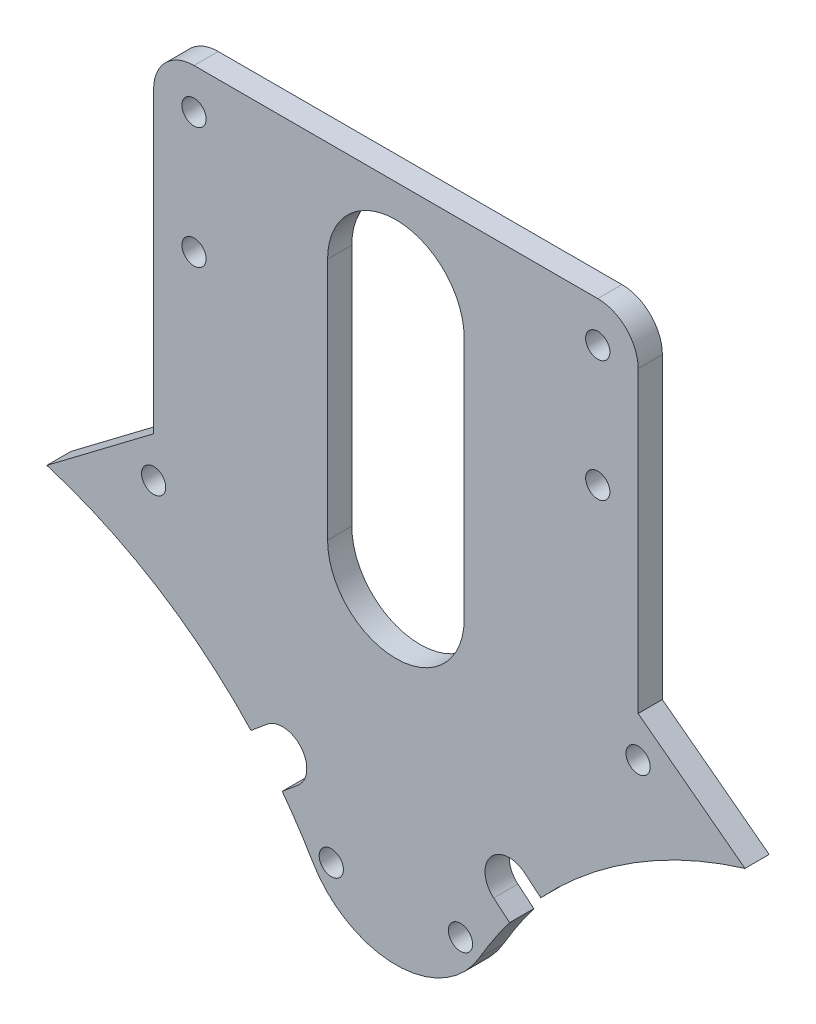
ISO-10303-21;
HEADER;
FILE_DESCRIPTION(('STEP AP214'),'2;1');
FILE_NAME('part.step','',(''),(''),'','','');
FILE_SCHEMA(('AUTOMOTIVE_DESIGN { 1 0 10303 214 1 1 1 1 }'));
ENDSEC;
DATA;
#1=APPLICATION_CONTEXT('core data for automotive mechanical design processes');
#2=APPLICATION_PROTOCOL_DEFINITION('international standard','automotive_design',2000,#1);
#3=PRODUCT_CONTEXT('',#1,'mechanical');
#4=PRODUCT('Part','Part','',(#3));
#5=PRODUCT_RELATED_PRODUCT_CATEGORY('part','',(#4));
#6=PRODUCT_DEFINITION_FORMATION('','',#4);
#7=PRODUCT_DEFINITION_CONTEXT('part definition',#1,'design');
#8=PRODUCT_DEFINITION('design','',#6,#7);
#9=PRODUCT_DEFINITION_SHAPE('','',#8);
#10=(LENGTH_UNIT() NAMED_UNIT(*) SI_UNIT(.MILLI.,.METRE.));
#11=(NAMED_UNIT(*) PLANE_ANGLE_UNIT() SI_UNIT($,.RADIAN.));
#12=(NAMED_UNIT(*) SI_UNIT($,.STERADIAN.) SOLID_ANGLE_UNIT());
#13=UNCERTAINTY_MEASURE_WITH_UNIT(LENGTH_MEASURE(1.E-05),#10,'distance_accuracy_value','');
#14=(GEOMETRIC_REPRESENTATION_CONTEXT(3) GLOBAL_UNCERTAINTY_ASSIGNED_CONTEXT((#13)) GLOBAL_UNIT_ASSIGNED_CONTEXT((#10,
#11,#12)) REPRESENTATION_CONTEXT('',''));
#15=CARTESIAN_POINT('',(0.,0.,0.));
#16=DIRECTION('',(0.,0.,1.));
#17=DIRECTION('',(1.,0.,0.));
#18=AXIS2_PLACEMENT_3D('',#15,#16,#17);
#19=CARTESIAN_POINT('',(-60.,-2.38152510246026E-13,3.));
#20=DIRECTION('',(0.,0.,-1.));
#21=DIRECTION('',(-1.,0.,0.));
#22=AXIS2_PLACEMENT_3D('',#19,#20,#21);
#23=CYLINDRICAL_SURFACE('',#22,57.5000000000001);
#24=CARTESIAN_POINT('',(-60.,-2.38152510246026E-13,3.));
#25=DIRECTION('',(0.,0.,1.));
#26=DIRECTION('',(1.,0.,0.));
#27=AXIS2_PLACEMENT_3D('',#24,#25,#26);
#28=CIRCLE('',#27,57.5000000000001);
#29=CARTESIAN_POINT('',(-14.0840738500869,34.6118148295597,3.));
#30=VERTEX_POINT('',#29);
#31=CARTESIAN_POINT('',(-10.3327131983401,28.972583967635,3.));
#32=VERTEX_POINT('',#31);
#33=EDGE_CURVE('E315',#30,#32,#28,.F.);
#34=ORIENTED_EDGE('',*,*,#33,.F.);
#35=DIRECTION('',(0.,0.,-1.));
#36=VECTOR('',#35,1.);
#37=CARTESIAN_POINT('',(-14.0840738500869,34.6118148295597,10.));
#38=LINE('',#37,#36);
#39=CARTESIAN_POINT('',(-14.0840738500869,34.6118148295597,0.));
#40=VERTEX_POINT('',#39);
#41=EDGE_CURVE('E261',#30,#40,#38,.T.);
#42=ORIENTED_EDGE('',*,*,#41,.T.);
#43=CARTESIAN_POINT('',(-60.,-2.38152510246026E-13,0.));
#44=DIRECTION('',(0.,0.,1.));
#45=DIRECTION('',(1.,0.,0.));
#46=AXIS2_PLACEMENT_3D('',#43,#44,#45);
#47=CIRCLE('',#46,57.5000000000001);
#48=CARTESIAN_POINT('',(-10.3327131983401,28.972583967635,0.));
#49=VERTEX_POINT('',#48);
#50=EDGE_CURVE('E348',#40,#49,#47,.F.);
#51=ORIENTED_EDGE('',*,*,#50,.T.);
#52=DIRECTION('',(0.,0.,-1.));
#53=VECTOR('',#52,1.);
#54=CARTESIAN_POINT('',(-10.3327131983401,28.972583967635,3.));
#55=LINE('',#54,#53);
#56=EDGE_CURVE('E369',#32,#49,#55,.T.);
#57=ORIENTED_EDGE('',*,*,#56,.F.);
#58=EDGE_LOOP('',(#34,#42,#51,#57));
#59=FACE_BOUND('',#58,.T.);
#60=ADVANCED_FACE('F36',(#59),#23,.F.);
#61=CARTESIAN_POINT('',(59.9999999999998,-4.18563751747614E-13,3.));
#62=DIRECTION('',(0.,0.,-1.));
#63=DIRECTION('',(-1.,0.,0.));
#64=AXIS2_PLACEMENT_3D('',#61,#62,#63);
#65=CYLINDRICAL_SURFACE('',#64,57.5000000000001);
#66=DIRECTION('',(0.,0.,-1.));
#67=VECTOR('',#66,1.);
#68=CARTESIAN_POINT('',(14.0840738500869,34.6118148295597,10.));
#69=LINE('',#68,#67);
#70=CARTESIAN_POINT('',(14.0840738500869,34.6118148295597,3.));
#71=VERTEX_POINT('',#70);
#72=CARTESIAN_POINT('',(14.0840738500869,34.6118148295597,0.));
#73=VERTEX_POINT('',#72);
#74=EDGE_CURVE('E278',#71,#73,#69,.T.);
#75=ORIENTED_EDGE('',*,*,#74,.F.);
#76=CARTESIAN_POINT('',(59.9999999999998,-4.18563751747614E-13,3.));
#77=DIRECTION('',(0.,0.,1.));
#78=DIRECTION('',(1.,0.,0.));
#79=AXIS2_PLACEMENT_3D('',#76,#77,#78);
#80=CIRCLE('',#79,57.5000000000001);
#81=CARTESIAN_POINT('',(10.33271319834,28.9725839676349,3.));
#82=VERTEX_POINT('',#81);
#83=EDGE_CURVE('E322',#71,#82,#80,.T.);
#84=ORIENTED_EDGE('',*,*,#83,.T.);
#85=DIRECTION('',(0.,0.,-1.));
#86=VECTOR('',#85,1.);
#87=CARTESIAN_POINT('',(10.33271319834,28.9725839676349,3.));
#88=LINE('',#87,#86);
#89=CARTESIAN_POINT('',(10.33271319834,28.9725839676349,0.));
#90=VERTEX_POINT('',#89);
#91=EDGE_CURVE('E366',#82,#90,#88,.T.);
#92=ORIENTED_EDGE('',*,*,#91,.T.);
#93=CARTESIAN_POINT('',(59.9999999999998,-4.18563751747614E-13,0.));
#94=DIRECTION('',(0.,0.,1.));
#95=DIRECTION('',(1.,0.,0.));
#96=AXIS2_PLACEMENT_3D('',#93,#94,#95);
#97=CIRCLE('',#96,57.5000000000001);
#98=EDGE_CURVE('E355',#73,#90,#97,.T.);
#99=ORIENTED_EDGE('',*,*,#98,.F.);
#100=EDGE_LOOP('',(#75,#84,#92,#99));
#101=FACE_BOUND('',#100,.T.);
#102=ADVANCED_FACE('F461',(#101),#65,.F.);
#103=CARTESIAN_POINT('',(-30.,0.,3.));
#104=DIRECTION('',(1.,0.,0.));
#105=DIRECTION('',(0.,1.,0.));
#106=AXIS2_PLACEMENT_3D('',#103,#104,#105);
#107=PLANE('',#106);
#108=DIRECTION('',(0.,-1.,0.));
#109=VECTOR('',#108,1.);
#110=CARTESIAN_POINT('',(-30.,0.,3.));
#111=LINE('',#110,#109);
#112=CARTESIAN_POINT('',(-30.,102.,3.));
#113=VERTEX_POINT('',#112);
#114=CARTESIAN_POINT('',(-30.,65.,3.));
#115=VERTEX_POINT('',#114);
#116=EDGE_CURVE('E310',#113,#115,#111,.T.);
#117=ORIENTED_EDGE('',*,*,#116,.F.);
#118=DIRECTION('',(0.,0.,-1.));
#119=VECTOR('',#118,1.);
#120=CARTESIAN_POINT('',(-30.,102.,3.));
#121=LINE('',#120,#119);
#122=CARTESIAN_POINT('',(-30.,102.,0.));
#123=VERTEX_POINT('',#122);
#124=EDGE_CURVE('E378',#113,#123,#121,.T.);
#125=ORIENTED_EDGE('',*,*,#124,.T.);
#126=DIRECTION('',(0.,-1.,0.));
#127=VECTOR('',#126,1.);
#128=CARTESIAN_POINT('',(-30.,0.,0.));
#129=LINE('',#128,#127);
#130=CARTESIAN_POINT('',(-30.,65.,0.));
#131=VERTEX_POINT('',#130);
#132=EDGE_CURVE('E343',#123,#131,#129,.T.);
#133=ORIENTED_EDGE('',*,*,#132,.T.);
#134=DIRECTION('',(0.,0.,-1.));
#135=VECTOR('',#134,1.);
#136=CARTESIAN_POINT('',(-30.,65.,3.));
#137=LINE('',#136,#135);
#138=EDGE_CURVE('E375',#115,#131,#137,.T.);
#139=ORIENTED_EDGE('',*,*,#138,.F.);
#140=EDGE_LOOP('',(#117,#125,#133,#139));
#141=FACE_BOUND('',#140,.T.);
#142=ADVANCED_FACE('F401',(#141),#107,.F.);
#143=CARTESIAN_POINT('',(-42.1758180792113,55.796457063803,3.));
#144=DIRECTION('',(0.603001408925935,-0.797740121112971,0.));
#145=DIRECTION('',(0.797740121112971,0.603001408925935,0.));
#146=AXIS2_PLACEMENT_3D('',#143,#144,#145);
#147=PLANE('',#146);
#148=DIRECTION('',(-0.797740121112971,-0.603001408925935,0.));
#149=VECTOR('',#148,1.);
#150=CARTESIAN_POINT('',(-42.1758180792113,55.796457063803,0.));
#151=LINE('',#150,#149);
#152=CARTESIAN_POINT('',(-43.2294901687526,55.0000000000001,0.));
#153=VERTEX_POINT('',#152);
#154=EDGE_CURVE('E345',#131,#153,#151,.T.);
#155=ORIENTED_EDGE('',*,*,#154,.T.);
#156=DIRECTION('',(0.,0.,-1.));
#157=VECTOR('',#156,1.);
#158=CARTESIAN_POINT('',(-43.2294901687526,55.0000000000001,3.));
#159=LINE('',#158,#157);
#160=CARTESIAN_POINT('',(-43.2294901687526,55.0000000000001,3.));
#161=VERTEX_POINT('',#160);
#162=EDGE_CURVE('E372',#161,#153,#159,.T.);
#163=ORIENTED_EDGE('',*,*,#162,.F.);
#164=DIRECTION('',(-0.797740121112971,-0.603001408925935,0.));
#165=VECTOR('',#164,1.);
#166=CARTESIAN_POINT('',(-42.1758180792113,55.796457063803,3.));
#167=LINE('',#166,#165);
#168=EDGE_CURVE('E312',#115,#161,#167,.T.);
#169=ORIENTED_EDGE('',*,*,#168,.F.);
#170=ORIENTED_EDGE('',*,*,#138,.T.);
#171=EDGE_LOOP('',(#155,#163,#169,#170));
#172=FACE_BOUND('',#171,.T.);
#173=ADVANCED_FACE('F476',(#172),#147,.F.);
#174=CARTESIAN_POINT('',(-17.9407995082063,39.2080814882735,0.));
#175=VERTEX_POINT('',#174);
#176=EDGE_CURVE('E349',#153,#175,#47,.F.);
#177=ORIENTED_EDGE('',*,*,#176,.T.);
#178=DIRECTION('',(0.,0.,-1.));
#179=VECTOR('',#178,1.);
#180=CARTESIAN_POINT('',(-17.9407995082063,39.2080814882735,10.));
#181=LINE('',#180,#179);
#182=CARTESIAN_POINT('',(-17.9407995082063,39.2080814882735,3.));
#183=VERTEX_POINT('',#182);
#184=EDGE_CURVE('E260',#183,#175,#181,.T.);
#185=ORIENTED_EDGE('',*,*,#184,.F.);
#186=EDGE_CURVE('E316',#161,#183,#28,.F.);
#187=ORIENTED_EDGE('',*,*,#186,.F.);
#188=ORIENTED_EDGE('',*,*,#162,.T.);
#189=EDGE_LOOP('',(#177,#185,#187,#188));
#190=FACE_BOUND('',#189,.T.);
#191=ADVANCED_FACE('F464',(#190),#23,.F.);
#192=CARTESIAN_POINT('',(0.,35.,3.));
#193=DIRECTION('',(0.,0.,-1.));
#194=DIRECTION('',(-1.,0.,0.));
#195=AXIS2_PLACEMENT_3D('',#192,#193,#194);
#196=CYLINDRICAL_SURFACE('',#195,11.962219947249);
#197=CARTESIAN_POINT('',(0.,35.,0.));
#198=DIRECTION('',(0.,0.,1.));
#199=DIRECTION('',(1.,0.,0.));
#200=AXIS2_PLACEMENT_3D('',#197,#198,#199);
#201=CIRCLE('',#200,11.962219947249);
#202=EDGE_CURVE('E352',#49,#90,#201,.T.);
#203=ORIENTED_EDGE('',*,*,#202,.T.);
#204=ORIENTED_EDGE('',*,*,#91,.F.);
#205=CARTESIAN_POINT('',(0.,35.,3.));
#206=DIRECTION('',(0.,0.,1.));
#207=DIRECTION('',(1.,0.,0.));
#208=AXIS2_PLACEMENT_3D('',#205,#206,#207);
#209=CIRCLE('',#208,11.962219947249);
#210=EDGE_CURVE('E319',#32,#82,#209,.T.);
#211=ORIENTED_EDGE('',*,*,#210,.F.);
#212=ORIENTED_EDGE('',*,*,#56,.T.);
#213=EDGE_LOOP('',(#203,#204,#211,#212));
#214=FACE_BOUND('',#213,.T.);
#215=ADVANCED_FACE('F475',(#214),#196,.T.);
#216=DIRECTION('',(0.,0.,-1.));
#217=VECTOR('',#216,1.);
#218=CARTESIAN_POINT('',(17.9407995082063,39.2080814882735,10.));
#219=LINE('',#218,#217);
#220=CARTESIAN_POINT('',(17.9407995082063,39.2080814882735,3.));
#221=VERTEX_POINT('',#220);
#222=CARTESIAN_POINT('',(17.9407995082063,39.2080814882735,0.));
#223=VERTEX_POINT('',#222);
#224=EDGE_CURVE('E280',#221,#223,#219,.T.);
#225=ORIENTED_EDGE('',*,*,#224,.T.);
#226=CARTESIAN_POINT('',(43.2294901687526,55.,0.));
#227=VERTEX_POINT('',#226);
#228=EDGE_CURVE('E356',#227,#223,#97,.T.);
#229=ORIENTED_EDGE('',*,*,#228,.F.);
#230=DIRECTION('',(0.,0.,-1.));
#231=VECTOR('',#230,1.);
#232=CARTESIAN_POINT('',(43.2294901687526,55.,3.));
#233=LINE('',#232,#231);
#234=CARTESIAN_POINT('',(43.2294901687526,55.,3.));
#235=VERTEX_POINT('',#234);
#236=EDGE_CURVE('E364',#235,#227,#233,.T.);
#237=ORIENTED_EDGE('',*,*,#236,.F.);
#238=EDGE_CURVE('E323',#235,#221,#80,.T.);
#239=ORIENTED_EDGE('',*,*,#238,.T.);
#240=EDGE_LOOP('',(#225,#229,#237,#239));
#241=FACE_BOUND('',#240,.T.);
#242=ADVANCED_FACE('F470',(#241),#65,.F.);
#243=CARTESIAN_POINT('',(42.1758180792115,55.7964570638027,3.));
#244=DIRECTION('',(0.603001408925939,0.797740121112968,0.));
#245=DIRECTION('',(-0.797740121112968,0.603001408925939,0.));
#246=AXIS2_PLACEMENT_3D('',#243,#244,#245);
#247=PLANE('',#246);
#248=DIRECTION('',(0.797740121112968,-0.603001408925939,0.));
#249=VECTOR('',#248,1.);
#250=CARTESIAN_POINT('',(42.1758180792115,55.7964570638027,0.));
#251=LINE('',#250,#249);
#252=CARTESIAN_POINT('',(30.,65.,0.));
#253=VERTEX_POINT('',#252);
#254=EDGE_CURVE('E359',#253,#227,#251,.T.);
#255=ORIENTED_EDGE('',*,*,#254,.F.);
#256=DIRECTION('',(0.,0.,-1.));
#257=VECTOR('',#256,1.);
#258=CARTESIAN_POINT('',(30.,65.,3.));
#259=LINE('',#258,#257);
#260=CARTESIAN_POINT('',(30.,65.,3.));
#261=VERTEX_POINT('',#260);
#262=EDGE_CURVE('E331',#261,#253,#259,.T.);
#263=ORIENTED_EDGE('',*,*,#262,.F.);
#264=DIRECTION('',(0.797740121112968,-0.603001408925939,0.));
#265=VECTOR('',#264,1.);
#266=CARTESIAN_POINT('',(42.1758180792115,55.7964570638027,3.));
#267=LINE('',#266,#265);
#268=EDGE_CURVE('E326',#261,#235,#267,.T.);
#269=ORIENTED_EDGE('',*,*,#268,.T.);
#270=ORIENTED_EDGE('',*,*,#236,.T.);
#271=EDGE_LOOP('',(#255,#263,#269,#270));
#272=FACE_BOUND('',#271,.T.);
#273=ADVANCED_FACE('F442',(#272),#247,.T.);
#274=CARTESIAN_POINT('',(-30.,60.,3.));
#275=DIRECTION('',(0.,0.,-1.));
#276=DIRECTION('',(-1.,0.,0.));
#277=AXIS2_PLACEMENT_3D('',#274,#275,#276);
#278=CYLINDRICAL_SURFACE('',#277,1.5);
#279=CARTESIAN_POINT('',(-30.,60.,3.));
#280=DIRECTION('',(0.,0.,1.));
#281=DIRECTION('',(1.,0.,0.));
#282=AXIS2_PLACEMENT_3D('',#279,#280,#281);
#283=CIRCLE('',#282,1.5);
#284=CARTESIAN_POINT('',(-28.5,60.,3.));
#285=VERTEX_POINT('',#284);
#286=EDGE_CURVE('E307',#285,#285,#283,.T.);
#287=ORIENTED_EDGE('',*,*,#286,.T.);
#288=EDGE_LOOP('',(#287));
#289=FACE_BOUND('',#288,.T.);
#290=CARTESIAN_POINT('',(-30.,60.,0.));
#291=DIRECTION('',(0.,0.,1.));
#292=DIRECTION('',(1.,0.,0.));
#293=AXIS2_PLACEMENT_3D('',#290,#291,#292);
#294=CIRCLE('',#293,1.5);
#295=CARTESIAN_POINT('',(-28.5,60.,0.));
#296=VERTEX_POINT('',#295);
#297=EDGE_CURVE('E340',#296,#296,#294,.T.);
#298=ORIENTED_EDGE('',*,*,#297,.F.);
#299=EDGE_LOOP('',(#298));
#300=FACE_BOUND('',#299,.T.);
#301=ADVANCED_FACE('F438',(#289,#300),#278,.F.);
#302=CARTESIAN_POINT('',(-8.00000000000001,30.,3.));
#303=DIRECTION('',(0.,0.,-1.));
#304=DIRECTION('',(-1.,0.,0.));
#305=AXIS2_PLACEMENT_3D('',#302,#303,#304);
#306=CYLINDRICAL_SURFACE('',#305,1.5);
#307=CARTESIAN_POINT('',(-8.00000000000001,30.,3.));
#308=DIRECTION('',(0.,0.,1.));
#309=DIRECTION('',(1.,0.,0.));
#310=AXIS2_PLACEMENT_3D('',#307,#308,#309);
#311=CIRCLE('',#310,1.5);
#312=CARTESIAN_POINT('',(-6.50000000000001,30.,3.));
#313=VERTEX_POINT('',#312);
#314=EDGE_CURVE('E304',#313,#313,#311,.T.);
#315=ORIENTED_EDGE('',*,*,#314,.T.);
#316=EDGE_LOOP('',(#315));
#317=FACE_BOUND('',#316,.T.);
#318=CARTESIAN_POINT('',(-8.00000000000001,30.,0.));
#319=DIRECTION('',(0.,0.,1.));
#320=DIRECTION('',(1.,0.,0.));
#321=AXIS2_PLACEMENT_3D('',#318,#319,#320);
#322=CIRCLE('',#321,1.5);
#323=CARTESIAN_POINT('',(-6.50000000000001,30.,0.));
#324=VERTEX_POINT('',#323);
#325=EDGE_CURVE('E337',#324,#324,#322,.T.);
#326=ORIENTED_EDGE('',*,*,#325,.F.);
#327=EDGE_LOOP('',(#326));
#328=FACE_BOUND('',#327,.T.);
#329=ADVANCED_FACE('F441',(#317,#328),#306,.F.);
#330=CARTESIAN_POINT('',(7.99999999999999,30.,3.));
#331=DIRECTION('',(0.,0.,-1.));
#332=DIRECTION('',(-1.,0.,0.));
#333=AXIS2_PLACEMENT_3D('',#330,#331,#332);
#334=CYLINDRICAL_SURFACE('',#333,1.5);
#335=CARTESIAN_POINT('',(7.99999999999999,30.,3.));
#336=DIRECTION('',(0.,0.,1.));
#337=DIRECTION('',(1.,0.,0.));
#338=AXIS2_PLACEMENT_3D('',#335,#336,#337);
#339=CIRCLE('',#338,1.5);
#340=CARTESIAN_POINT('',(9.49999999999999,30.,3.));
#341=VERTEX_POINT('',#340);
#342=EDGE_CURVE('E300',#341,#341,#339,.T.);
#343=ORIENTED_EDGE('',*,*,#342,.T.);
#344=EDGE_LOOP('',(#343));
#345=FACE_BOUND('',#344,.T.);
#346=CARTESIAN_POINT('',(7.99999999999999,30.,0.));
#347=DIRECTION('',(0.,0.,1.));
#348=DIRECTION('',(1.,0.,0.));
#349=AXIS2_PLACEMENT_3D('',#346,#347,#348);
#350=CIRCLE('',#349,1.5);
#351=CARTESIAN_POINT('',(9.49999999999999,30.,0.));
#352=VERTEX_POINT('',#351);
#353=EDGE_CURVE('E334',#352,#352,#350,.T.);
#354=ORIENTED_EDGE('',*,*,#353,.F.);
#355=EDGE_LOOP('',(#354));
#356=FACE_BOUND('',#355,.T.);
#357=ADVANCED_FACE('F533',(#345,#356),#334,.F.);
#358=CARTESIAN_POINT('',(30.,60.,3.));
#359=DIRECTION('',(0.,0.,-1.));
#360=DIRECTION('',(-1.,0.,0.));
#361=AXIS2_PLACEMENT_3D('',#358,#359,#360);
#362=CYLINDRICAL_SURFACE('',#361,1.5);
#363=CARTESIAN_POINT('',(30.,60.,3.));
#364=DIRECTION('',(0.,0.,1.));
#365=DIRECTION('',(1.,0.,0.));
#366=AXIS2_PLACEMENT_3D('',#363,#364,#365);
#367=CIRCLE('',#366,1.5);
#368=CARTESIAN_POINT('',(31.5,60.,3.));
#369=VERTEX_POINT('',#368);
#370=EDGE_CURVE('E297',#369,#369,#367,.T.);
#371=ORIENTED_EDGE('',*,*,#370,.T.);
#372=EDGE_LOOP('',(#371));
#373=FACE_BOUND('',#372,.T.);
#374=CARTESIAN_POINT('',(30.,60.,0.));
#375=DIRECTION('',(0.,0.,1.));
#376=DIRECTION('',(1.,0.,0.));
#377=AXIS2_PLACEMENT_3D('',#374,#375,#376);
#378=CIRCLE('',#377,1.5);
#379=CARTESIAN_POINT('',(31.5,60.,0.));
#380=VERTEX_POINT('',#379);
#381=EDGE_CURVE('E296',#380,#380,#378,.T.);
#382=ORIENTED_EDGE('',*,*,#381,.F.);
#383=EDGE_LOOP('',(#382));
#384=FACE_BOUND('',#383,.T.);
#385=ADVANCED_FACE('F528',(#373,#384),#362,.F.);
#386=CARTESIAN_POINT('',(30.,0.,3.));
#387=DIRECTION('',(-1.,0.,0.));
#388=DIRECTION('',(0.,-1.,0.));
#389=AXIS2_PLACEMENT_3D('',#386,#387,#388);
#390=PLANE('',#389);
#391=DIRECTION('',(0.,1.,0.));
#392=VECTOR('',#391,1.);
#393=CARTESIAN_POINT('',(30.,0.,0.));
#394=LINE('',#393,#392);
#395=CARTESIAN_POINT('',(30.,102.,0.));
#396=VERTEX_POINT('',#395);
#397=EDGE_CURVE('E301',#253,#396,#394,.T.);
#398=ORIENTED_EDGE('',*,*,#397,.T.);
#399=DIRECTION('',(0.,0.,-1.));
#400=VECTOR('',#399,1.);
#401=CARTESIAN_POINT('',(30.,102.,3.));
#402=LINE('',#401,#400);
#403=CARTESIAN_POINT('',(30.,102.,3.));
#404=VERTEX_POINT('',#403);
#405=EDGE_CURVE('E11',#396,#404,#402,.F.);
#406=ORIENTED_EDGE('',*,*,#405,.T.);
#407=DIRECTION('',(0.,1.,0.));
#408=VECTOR('',#407,1.);
#409=CARTESIAN_POINT('',(30.,0.,3.));
#410=LINE('',#409,#408);
#411=EDGE_CURVE('E329',#261,#404,#410,.T.);
#412=ORIENTED_EDGE('',*,*,#411,.F.);
#413=ORIENTED_EDGE('',*,*,#262,.T.);
#414=EDGE_LOOP('',(#398,#406,#412,#413));
#415=FACE_BOUND('',#414,.T.);
#416=ADVANCED_FACE('F426',(#415),#390,.F.);
#417=CARTESIAN_POINT('',(0.,0.,3.));
#418=DIRECTION('',(0.,0.,1.));
#419=DIRECTION('',(1.,0.,0.));
#420=AXIS2_PLACEMENT_3D('',#417,#418,#419);
#421=PLANE('',#420);
#422=DIRECTION('',(1.,0.,0.));
#423=VECTOR('',#422,1.);
#424=CARTESIAN_POINT('',(0.,107.,3.));
#425=LINE('',#424,#423);
#426=CARTESIAN_POINT('',(-25.,107.,3.));
#427=VERTEX_POINT('',#426);
#428=CARTESIAN_POINT('',(25.,107.,3.));
#429=VERTEX_POINT('',#428);
#430=EDGE_CURVE('E395',#427,#429,#425,.T.);
#431=ORIENTED_EDGE('',*,*,#430,.F.);
#432=CARTESIAN_POINT('',(-25.,102.,3.));
#433=DIRECTION('',(0.,0.,1.));
#434=DIRECTION('',(1.,0.,0.));
#435=AXIS2_PLACEMENT_3D('',#432,#433,#434);
#436=CIRCLE('',#435,5.);
#437=EDGE_CURVE('E44',#427,#113,#436,.T.);
#438=ORIENTED_EDGE('',*,*,#437,.T.);
#439=ORIENTED_EDGE('',*,*,#116,.T.);
#440=ORIENTED_EDGE('',*,*,#168,.T.);
#441=ORIENTED_EDGE('',*,*,#186,.T.);
#442=DIRECTION('',(-0.766044443118908,-0.642787609686622,0.));
#443=VECTOR('',#442,1.);
#444=CARTESIAN_POINT('',(-26.718917499055,31.8423659197201,3.));
#445=LINE('',#444,#443);
#446=CARTESIAN_POINT('',(-15.965696241921,40.865389910549,3.));
#447=VERTEX_POINT('',#446);
#448=EDGE_CURVE('E290',#447,#183,#445,.T.);
#449=ORIENTED_EDGE('',*,*,#448,.F.);
#450=CARTESIAN_POINT('',(-14.0373334128611,38.5672565811921,3.));
#451=DIRECTION('',(0.,0.,1.));
#452=DIRECTION('',(1.,0.,0.));
#453=AXIS2_PLACEMENT_3D('',#450,#451,#452);
#454=CIRCLE('',#453,3.00000000000015);
#455=CARTESIAN_POINT('',(-12.1089705838025,36.269123251836,3.));
#456=VERTEX_POINT('',#455);
#457=EDGE_CURVE('E292',#456,#447,#454,.T.);
#458=ORIENTED_EDGE('',*,*,#457,.F.);
#459=DIRECTION('',(0.766044443118978,0.642787609686539,0.));
#460=VECTOR('',#459,1.);
#461=CARTESIAN_POINT('',(-22.8621918409331,27.24609926101,3.));
#462=LINE('',#461,#460);
#463=EDGE_CURVE('E294',#30,#456,#462,.T.);
#464=ORIENTED_EDGE('',*,*,#463,.F.);
#465=ORIENTED_EDGE('',*,*,#33,.T.);
#466=ORIENTED_EDGE('',*,*,#210,.T.);
#467=ORIENTED_EDGE('',*,*,#83,.F.);
#468=DIRECTION('',(0.766044443118971,-0.642787609686547,0.));
#469=VECTOR('',#468,1.);
#470=CARTESIAN_POINT('',(22.8621918409333,27.2460992610097,3.));
#471=LINE('',#470,#469);
#472=CARTESIAN_POINT('',(12.1089705838025,36.269123251836,3.));
#473=VERTEX_POINT('',#472);
#474=EDGE_CURVE('E286',#473,#71,#471,.T.);
#475=ORIENTED_EDGE('',*,*,#474,.F.);
#476=CARTESIAN_POINT('',(14.0373334128622,38.567256581193,3.));
#477=DIRECTION('',(0.,0.,1.));
#478=DIRECTION('',(1.,0.,0.));
#479=AXIS2_PLACEMENT_3D('',#476,#477,#478);
#480=CIRCLE('',#479,3.00000000000015);
#481=CARTESIAN_POINT('',(15.9656962419219,40.8653899105501,3.));
#482=VERTEX_POINT('',#481);
#483=EDGE_CURVE('E288',#482,#473,#480,.T.);
#484=ORIENTED_EDGE('',*,*,#483,.F.);
#485=DIRECTION('',(-0.766044443118904,0.642787609686627,0.));
#486=VECTOR('',#485,1.);
#487=CARTESIAN_POINT('',(26.7189174990551,31.8423659197198,3.));
#488=LINE('',#487,#486);
#489=EDGE_CURVE('E264',#221,#482,#488,.T.);
#490=ORIENTED_EDGE('',*,*,#489,.F.);
#491=ORIENTED_EDGE('',*,*,#238,.F.);
#492=ORIENTED_EDGE('',*,*,#268,.F.);
#493=ORIENTED_EDGE('',*,*,#411,.T.);
#494=CARTESIAN_POINT('',(25.,102.,3.));
#495=DIRECTION('',(0.,0.,1.));
#496=DIRECTION('',(1.,0.,0.));
#497=AXIS2_PLACEMENT_3D('',#494,#495,#496);
#498=CIRCLE('',#497,5.);
#499=EDGE_CURVE('E56',#404,#429,#498,.T.);
#500=ORIENTED_EDGE('',*,*,#499,.T.);
#501=EDGE_LOOP('',(#431,#438,#439,#440,#441,#449,#458,#464,#465,#466,#467,#475,#484,#490,#491,
#492,#493,#500));
#502=FACE_BOUND('',#501,.T.);
#503=CARTESIAN_POINT('',(25.,87.,3.));
#504=DIRECTION('',(0.,0.,1.));
#505=DIRECTION('',(1.,0.,0.));
#506=AXIS2_PLACEMENT_3D('',#503,#504,#505);
#507=CIRCLE('',#506,1.5);
#508=CARTESIAN_POINT('',(26.5,87.,3.));
#509=VERTEX_POINT('',#508);
#510=EDGE_CURVE('E247',#509,#509,#507,.T.);
#511=ORIENTED_EDGE('',*,*,#510,.F.);
#512=EDGE_LOOP('',(#511));
#513=FACE_BOUND('',#512,.T.);
#514=CARTESIAN_POINT('',(-25.,102.,3.));
#515=DIRECTION('',(0.,0.,1.));
#516=DIRECTION('',(1.,0.,0.));
#517=AXIS2_PLACEMENT_3D('',#514,#515,#516);
#518=CIRCLE('',#517,1.5);
#519=CARTESIAN_POINT('',(-23.5,102.,3.));
#520=VERTEX_POINT('',#519);
#521=EDGE_CURVE('E244',#520,#520,#518,.T.);
#522=ORIENTED_EDGE('',*,*,#521,.F.);
#523=EDGE_LOOP('',(#522));
#524=FACE_BOUND('',#523,.T.);
#525=CARTESIAN_POINT('',(-25.,87.,3.));
#526=DIRECTION('',(0.,0.,1.));
#527=DIRECTION('',(1.,0.,0.));
#528=AXIS2_PLACEMENT_3D('',#525,#526,#527);
#529=CIRCLE('',#528,1.5);
#530=CARTESIAN_POINT('',(-23.5,87.,3.));
#531=VERTEX_POINT('',#530);
#532=EDGE_CURVE('E241',#531,#531,#529,.T.);
#533=ORIENTED_EDGE('',*,*,#532,.F.);
#534=EDGE_LOOP('',(#533));
#535=FACE_BOUND('',#534,.T.);
#536=CARTESIAN_POINT('',(0.,64.355158964007,3.));
#537=DIRECTION('',(0.,0.,1.));
#538=DIRECTION('',(1.,0.,0.));
#539=AXIS2_PLACEMENT_3D('',#536,#537,#538);
#540=CIRCLE('',#539,8.4588962361882);
#541=CARTESIAN_POINT('',(-8.45889623618823,64.355158964007,3.));
#542=VERTEX_POINT('',#541);
#543=CARTESIAN_POINT('',(8.45889623618818,64.355158964007,3.));
#544=VERTEX_POINT('',#543);
#545=EDGE_CURVE('E239',#542,#544,#540,.T.);
#546=ORIENTED_EDGE('',*,*,#545,.F.);
#547=DIRECTION('',(0.,-1.,0.));
#548=VECTOR('',#547,1.);
#549=CARTESIAN_POINT('',(-8.45889623618823,0.,3.));
#550=LINE('',#549,#548);
#551=CARTESIAN_POINT('',(-8.45889623618823,94.5,3.));
#552=VERTEX_POINT('',#551);
#553=EDGE_CURVE('E234',#552,#542,#550,.T.);
#554=ORIENTED_EDGE('',*,*,#553,.F.);
#555=CARTESIAN_POINT('',(0.,94.5,3.));
#556=DIRECTION('',(0.,0.,1.));
#557=DIRECTION('',(1.,0.,0.));
#558=AXIS2_PLACEMENT_3D('',#555,#556,#557);
#559=CIRCLE('',#558,8.4588962361882);
#560=CARTESIAN_POINT('',(8.45889623618818,94.5,3.));
#561=VERTEX_POINT('',#560);
#562=EDGE_CURVE('E194',#561,#552,#559,.T.);
#563=ORIENTED_EDGE('',*,*,#562,.F.);
#564=DIRECTION('',(0.,1.,0.));
#565=VECTOR('',#564,1.);
#566=CARTESIAN_POINT('',(8.45889623618818,0.,3.));
#567=LINE('',#566,#565);
#568=EDGE_CURVE('E237',#544,#561,#567,.T.);
#569=ORIENTED_EDGE('',*,*,#568,.F.);
#570=EDGE_LOOP('',(#546,#554,#563,#569));
#571=FACE_BOUND('',#570,.T.);
#572=CARTESIAN_POINT('',(25.,102.,3.));
#573=DIRECTION('',(0.,0.,1.));
#574=DIRECTION('',(1.,0.,0.));
#575=AXIS2_PLACEMENT_3D('',#572,#573,#574);
#576=CIRCLE('',#575,1.5);
#577=CARTESIAN_POINT('',(26.5,102.,3.));
#578=VERTEX_POINT('',#577);
#579=EDGE_CURVE('E231',#578,#578,#576,.T.);
#580=ORIENTED_EDGE('',*,*,#579,.F.);
#581=EDGE_LOOP('',(#580));
#582=FACE_BOUND('',#581,.T.);
#583=ORIENTED_EDGE('',*,*,#370,.F.);
#584=EDGE_LOOP('',(#583));
#585=FACE_BOUND('',#584,.T.);
#586=ORIENTED_EDGE('',*,*,#342,.F.);
#587=EDGE_LOOP('',(#586));
#588=FACE_BOUND('',#587,.T.);
#589=ORIENTED_EDGE('',*,*,#314,.F.);
#590=EDGE_LOOP('',(#589));
#591=FACE_BOUND('',#590,.T.);
#592=ORIENTED_EDGE('',*,*,#286,.F.);
#593=EDGE_LOOP('',(#592));
#594=FACE_BOUND('',#593,.T.);
#595=ADVANCED_FACE('F392',(#502,#513,#524,#535,#571,#582,#585,#588,#591,#594),#421,.T.);
#596=CARTESIAN_POINT('',(0.,0.,0.));
#597=DIRECTION('',(0.,0.,1.));
#598=DIRECTION('',(1.,0.,0.));
#599=AXIS2_PLACEMENT_3D('',#596,#597,#598);
#600=PLANE('',#599);
#601=CARTESIAN_POINT('',(25.,87.,0.));
#602=DIRECTION('',(0.,0.,-1.));
#603=DIRECTION('',(-1.,0.,0.));
#604=AXIS2_PLACEMENT_3D('',#601,#602,#603);
#605=CIRCLE('',#604,1.5);
#606=CARTESIAN_POINT('',(23.5,87.,0.));
#607=VERTEX_POINT('',#606);
#608=EDGE_CURVE('E222',#607,#607,#605,.T.);
#609=ORIENTED_EDGE('',*,*,#608,.F.);
#610=EDGE_LOOP('',(#609));
#611=FACE_BOUND('',#610,.T.);
#612=CARTESIAN_POINT('',(-25.,102.,0.));
#613=DIRECTION('',(0.,0.,-1.));
#614=DIRECTION('',(-1.,0.,0.));
#615=AXIS2_PLACEMENT_3D('',#612,#613,#614);
#616=CIRCLE('',#615,1.5);
#617=CARTESIAN_POINT('',(-26.5,102.,0.));
#618=VERTEX_POINT('',#617);
#619=EDGE_CURVE('E226',#618,#618,#616,.T.);
#620=ORIENTED_EDGE('',*,*,#619,.F.);
#621=EDGE_LOOP('',(#620));
#622=FACE_BOUND('',#621,.T.);
#623=CARTESIAN_POINT('',(-25.,87.,0.));
#624=DIRECTION('',(0.,0.,-1.));
#625=DIRECTION('',(-1.,0.,0.));
#626=AXIS2_PLACEMENT_3D('',#623,#624,#625);
#627=CIRCLE('',#626,1.5);
#628=CARTESIAN_POINT('',(-26.5,87.,0.));
#629=VERTEX_POINT('',#628);
#630=EDGE_CURVE('E219',#629,#629,#627,.T.);
#631=ORIENTED_EDGE('',*,*,#630,.F.);
#632=EDGE_LOOP('',(#631));
#633=FACE_BOUND('',#632,.T.);
#634=DIRECTION('',(0.,1.,0.));
#635=VECTOR('',#634,1.);
#636=CARTESIAN_POINT('',(-8.45889623618823,64.355158964007,0.));
#637=LINE('',#636,#635);
#638=CARTESIAN_POINT('',(-8.45889623618823,64.355158964007,0.));
#639=VERTEX_POINT('',#638);
#640=CARTESIAN_POINT('',(-8.45889623618823,94.5,0.));
#641=VERTEX_POINT('',#640);
#642=EDGE_CURVE('E202',#639,#641,#637,.T.);
#643=ORIENTED_EDGE('',*,*,#642,.F.);
#644=CARTESIAN_POINT('',(0.,64.355158964007,0.));
#645=DIRECTION('',(0.,0.,-1.));
#646=DIRECTION('',(-1.,0.,0.));
#647=AXIS2_PLACEMENT_3D('',#644,#645,#646);
#648=CIRCLE('',#647,8.4588962361882);
#649=CARTESIAN_POINT('',(8.45889623618818,64.355158964007,0.));
#650=VERTEX_POINT('',#649);
#651=EDGE_CURVE('E207',#650,#639,#648,.T.);
#652=ORIENTED_EDGE('',*,*,#651,.F.);
#653=DIRECTION('',(0.,-1.,0.));
#654=VECTOR('',#653,1.);
#655=CARTESIAN_POINT('',(8.45889623618818,64.355158964007,0.));
#656=LINE('',#655,#654);
#657=CARTESIAN_POINT('',(8.45889623618818,94.5,0.));
#658=VERTEX_POINT('',#657);
#659=EDGE_CURVE('E212',#658,#650,#656,.T.);
#660=ORIENTED_EDGE('',*,*,#659,.F.);
#661=CARTESIAN_POINT('',(0.,94.5,0.));
#662=DIRECTION('',(0.,0.,-1.));
#663=DIRECTION('',(-1.,0.,0.));
#664=AXIS2_PLACEMENT_3D('',#661,#662,#663);
#665=CIRCLE('',#664,8.4588962361882);
#666=EDGE_CURVE('E191',#641,#658,#665,.T.);
#667=ORIENTED_EDGE('',*,*,#666,.F.);
#668=EDGE_LOOP('',(#643,#652,#660,#667));
#669=FACE_BOUND('',#668,.T.);
#670=CARTESIAN_POINT('',(25.,102.,0.));
#671=DIRECTION('',(0.,0.,-1.));
#672=DIRECTION('',(-1.,0.,0.));
#673=AXIS2_PLACEMENT_3D('',#670,#671,#672);
#674=CIRCLE('',#673,1.5);
#675=CARTESIAN_POINT('',(23.5,102.,0.));
#676=VERTEX_POINT('',#675);
#677=EDGE_CURVE('E225',#676,#676,#674,.T.);
#678=ORIENTED_EDGE('',*,*,#677,.F.);
#679=EDGE_LOOP('',(#678));
#680=FACE_BOUND('',#679,.T.);
#681=ORIENTED_EDGE('',*,*,#381,.T.);
#682=EDGE_LOOP('',(#681));
#683=FACE_BOUND('',#682,.T.);
#684=ORIENTED_EDGE('',*,*,#353,.T.);
#685=EDGE_LOOP('',(#684));
#686=FACE_BOUND('',#685,.T.);
#687=ORIENTED_EDGE('',*,*,#325,.T.);
#688=EDGE_LOOP('',(#687));
#689=FACE_BOUND('',#688,.T.);
#690=ORIENTED_EDGE('',*,*,#297,.T.);
#691=EDGE_LOOP('',(#690));
#692=FACE_BOUND('',#691,.T.);
#693=ORIENTED_EDGE('',*,*,#132,.F.);
#694=CARTESIAN_POINT('',(-25.,102.,0.));
#695=DIRECTION('',(0.,0.,1.));
#696=DIRECTION('',(1.,0.,0.));
#697=AXIS2_PLACEMENT_3D('',#694,#695,#696);
#698=CIRCLE('',#697,5.);
#699=CARTESIAN_POINT('',(-25.,107.,0.));
#700=VERTEX_POINT('',#699);
#701=EDGE_CURVE('E383',#123,#700,#698,.F.);
#702=ORIENTED_EDGE('',*,*,#701,.T.);
#703=DIRECTION('',(-1.,0.,0.));
#704=VECTOR('',#703,1.);
#705=CARTESIAN_POINT('',(30.,107.,0.));
#706=LINE('',#705,#704);
#707=CARTESIAN_POINT('',(25.,107.,0.));
#708=VERTEX_POINT('',#707);
#709=EDGE_CURVE('E407',#708,#700,#706,.T.);
#710=ORIENTED_EDGE('',*,*,#709,.F.);
#711=CARTESIAN_POINT('',(25.,102.,0.));
#712=DIRECTION('',(0.,0.,1.));
#713=DIRECTION('',(1.,0.,0.));
#714=AXIS2_PLACEMENT_3D('',#711,#712,#713);
#715=CIRCLE('',#714,5.);
#716=EDGE_CURVE('E381',#708,#396,#715,.F.);
#717=ORIENTED_EDGE('',*,*,#716,.T.);
#718=ORIENTED_EDGE('',*,*,#397,.F.);
#719=ORIENTED_EDGE('',*,*,#254,.T.);
#720=ORIENTED_EDGE('',*,*,#228,.T.);
#721=DIRECTION('',(0.766044443118904,-0.642787609686627,0.));
#722=VECTOR('',#721,1.);
#723=CARTESIAN_POINT('',(17.9407995082063,39.2080814882735,0.));
#724=LINE('',#723,#722);
#725=CARTESIAN_POINT('',(15.9656962419219,40.8653899105501,0.));
#726=VERTEX_POINT('',#725);
#727=EDGE_CURVE('E271',#726,#223,#724,.T.);
#728=ORIENTED_EDGE('',*,*,#727,.F.);
#729=CARTESIAN_POINT('',(14.0373334128622,38.567256581193,0.));
#730=DIRECTION('',(0.,0.,-1.));
#731=DIRECTION('',(1.,0.,0.));
#732=AXIS2_PLACEMENT_3D('',#729,#730,#731);
#733=CIRCLE('',#732,3.00000000000015);
#734=CARTESIAN_POINT('',(12.1089705838025,36.269123251836,0.));
#735=VERTEX_POINT('',#734);
#736=EDGE_CURVE('E250',#735,#726,#733,.T.);
#737=ORIENTED_EDGE('',*,*,#736,.F.);
#738=DIRECTION('',(-0.766044443118971,0.642787609686547,0.));
#739=VECTOR('',#738,1.);
#740=CARTESIAN_POINT('',(14.0840738500869,34.6118148295597,0.));
#741=LINE('',#740,#739);
#742=EDGE_CURVE('E273',#73,#735,#741,.T.);
#743=ORIENTED_EDGE('',*,*,#742,.F.);
#744=ORIENTED_EDGE('',*,*,#98,.T.);
#745=ORIENTED_EDGE('',*,*,#202,.F.);
#746=ORIENTED_EDGE('',*,*,#50,.F.);
#747=DIRECTION('',(-0.766044443118978,-0.642787609686539,0.));
#748=VECTOR('',#747,1.);
#749=CARTESIAN_POINT('',(-14.0840738500869,34.6118148295597,0.));
#750=LINE('',#749,#748);
#751=CARTESIAN_POINT('',(-12.1089705838025,36.269123251836,0.));
#752=VERTEX_POINT('',#751);
#753=EDGE_CURVE('E258',#752,#40,#750,.T.);
#754=ORIENTED_EDGE('',*,*,#753,.F.);
#755=CARTESIAN_POINT('',(-14.0373334128611,38.5672565811921,0.));
#756=DIRECTION('',(0.,0.,-1.));
#757=DIRECTION('',(-1.,0.,0.));
#758=AXIS2_PLACEMENT_3D('',#755,#756,#757);
#759=CIRCLE('',#758,3.00000000000015);
#760=CARTESIAN_POINT('',(-15.965696241921,40.865389910549,0.));
#761=VERTEX_POINT('',#760);
#762=EDGE_CURVE('E254',#761,#752,#759,.T.);
#763=ORIENTED_EDGE('',*,*,#762,.F.);
#764=DIRECTION('',(0.766044443118908,0.642787609686622,0.));
#765=VECTOR('',#764,1.);
#766=CARTESIAN_POINT('',(-17.9407995082063,39.2080814882735,0.));
#767=LINE('',#766,#765);
#768=EDGE_CURVE('E251',#175,#761,#767,.T.);
#769=ORIENTED_EDGE('',*,*,#768,.F.);
#770=ORIENTED_EDGE('',*,*,#176,.F.);
#771=ORIENTED_EDGE('',*,*,#154,.F.);
#772=EDGE_LOOP('',(#693,#702,#710,#717,#718,#719,#720,#728,#737,#743,#744,#745,#746,#754,#763,
#769,#770,#771));
#773=FACE_BOUND('',#772,.T.);
#774=ADVANCED_FACE('F209',(#611,#622,#633,#669,#680,#683,#686,#689,#692,#773),#600,.F.);
#775=CARTESIAN_POINT('',(14.0373334128622,38.567256581193,10.));
#776=DIRECTION('',(0.,0.,-1.));
#777=DIRECTION('',(-1.,0.,0.));
#778=AXIS2_PLACEMENT_3D('',#775,#776,#777);
#779=CYLINDRICAL_SURFACE('',#778,3.00000000000015);
#780=ORIENTED_EDGE('',*,*,#483,.T.);
#781=DIRECTION('',(0.,0.,-1.));
#782=VECTOR('',#781,1.);
#783=CARTESIAN_POINT('',(12.1089705838025,36.269123251836,10.));
#784=LINE('',#783,#782);
#785=EDGE_CURVE('E255',#473,#735,#784,.T.);
#786=ORIENTED_EDGE('',*,*,#785,.T.);
#787=ORIENTED_EDGE('',*,*,#736,.T.);
#788=DIRECTION('',(0.,0.,-1.));
#789=VECTOR('',#788,1.);
#790=CARTESIAN_POINT('',(15.9656962419219,40.8653899105501,10.));
#791=LINE('',#790,#789);
#792=EDGE_CURVE('E276',#482,#726,#791,.T.);
#793=ORIENTED_EDGE('',*,*,#792,.F.);
#794=EDGE_LOOP('',(#780,#786,#787,#793));
#795=FACE_BOUND('',#794,.T.);
#796=ADVANCED_FACE('F447',(#795),#779,.F.);
#797=CARTESIAN_POINT('',(14.0840738500869,34.6118148295597,10.));
#798=DIRECTION('',(-0.642787609686547,-0.766044443118971,0.));
#799=DIRECTION('',(0.766044443118971,-0.642787609686547,0.));
#800=AXIS2_PLACEMENT_3D('',#797,#798,#799);
#801=PLANE('',#800);
#802=ORIENTED_EDGE('',*,*,#474,.T.);
#803=ORIENTED_EDGE('',*,*,#74,.T.);
#804=ORIENTED_EDGE('',*,*,#742,.T.);
#805=ORIENTED_EDGE('',*,*,#785,.F.);
#806=EDGE_LOOP('',(#802,#803,#804,#805));
#807=FACE_BOUND('',#806,.T.);
#808=ADVANCED_FACE('F454',(#807),#801,.F.);
#809=CARTESIAN_POINT('',(17.9407995082063,39.2080814882735,10.));
#810=DIRECTION('',(0.642787609686627,0.766044443118904,0.));
#811=DIRECTION('',(-0.766044443118904,0.642787609686627,0.));
#812=AXIS2_PLACEMENT_3D('',#809,#810,#811);
#813=PLANE('',#812);
#814=ORIENTED_EDGE('',*,*,#489,.T.);
#815=ORIENTED_EDGE('',*,*,#792,.T.);
#816=ORIENTED_EDGE('',*,*,#727,.T.);
#817=ORIENTED_EDGE('',*,*,#224,.F.);
#818=EDGE_LOOP('',(#814,#815,#816,#817));
#819=FACE_BOUND('',#818,.T.);
#820=ADVANCED_FACE('F517',(#819),#813,.F.);
#821=CARTESIAN_POINT('',(-14.0840738500869,34.6118148295597,10.));
#822=DIRECTION('',(0.642787609686539,-0.766044443118978,0.));
#823=DIRECTION('',(0.766044443118978,0.642787609686539,0.));
#824=AXIS2_PLACEMENT_3D('',#821,#822,#823);
#825=PLANE('',#824);
#826=ORIENTED_EDGE('',*,*,#463,.T.);
#827=DIRECTION('',(0.,0.,-1.));
#828=VECTOR('',#827,1.);
#829=CARTESIAN_POINT('',(-12.1089705838025,36.269123251836,10.));
#830=LINE('',#829,#828);
#831=EDGE_CURVE('E265',#456,#752,#830,.T.);
#832=ORIENTED_EDGE('',*,*,#831,.T.);
#833=ORIENTED_EDGE('',*,*,#753,.T.);
#834=ORIENTED_EDGE('',*,*,#41,.F.);
#835=EDGE_LOOP('',(#826,#832,#833,#834));
#836=FACE_BOUND('',#835,.T.);
#837=ADVANCED_FACE('F499',(#836),#825,.F.);
#838=CARTESIAN_POINT('',(-14.0373334128611,38.5672565811921,10.));
#839=DIRECTION('',(0.,0.,-1.));
#840=DIRECTION('',(-1.,0.,0.));
#841=AXIS2_PLACEMENT_3D('',#838,#839,#840);
#842=CYLINDRICAL_SURFACE('',#841,3.00000000000015);
#843=ORIENTED_EDGE('',*,*,#457,.T.);
#844=DIRECTION('',(0.,0.,-1.));
#845=VECTOR('',#844,1.);
#846=CARTESIAN_POINT('',(-15.965696241921,40.865389910549,10.));
#847=LINE('',#846,#845);
#848=EDGE_CURVE('E267',#447,#761,#847,.T.);
#849=ORIENTED_EDGE('',*,*,#848,.T.);
#850=ORIENTED_EDGE('',*,*,#762,.T.);
#851=ORIENTED_EDGE('',*,*,#831,.F.);
#852=EDGE_LOOP('',(#843,#849,#850,#851));
#853=FACE_BOUND('',#852,.T.);
#854=ADVANCED_FACE('F497',(#853),#842,.F.);
#855=CARTESIAN_POINT('',(-17.9407995082063,39.2080814882735,10.));
#856=DIRECTION('',(-0.642787609686622,0.766044443118908,0.));
#857=DIRECTION('',(-0.766044443118908,-0.642787609686622,0.));
#858=AXIS2_PLACEMENT_3D('',#855,#856,#857);
#859=PLANE('',#858);
#860=ORIENTED_EDGE('',*,*,#448,.T.);
#861=ORIENTED_EDGE('',*,*,#184,.T.);
#862=ORIENTED_EDGE('',*,*,#768,.T.);
#863=ORIENTED_EDGE('',*,*,#848,.F.);
#864=EDGE_LOOP('',(#860,#861,#862,#863));
#865=FACE_BOUND('',#864,.T.);
#866=ADVANCED_FACE('F491',(#865),#859,.F.);
#867=CARTESIAN_POINT('',(25.,102.,10.));
#868=DIRECTION('',(0.,0.,-1.));
#869=DIRECTION('',(-1.,0.,0.));
#870=AXIS2_PLACEMENT_3D('',#867,#868,#869);
#871=CYLINDRICAL_SURFACE('',#870,1.5);
#872=ORIENTED_EDGE('',*,*,#579,.T.);
#873=EDGE_LOOP('',(#872));
#874=FACE_BOUND('',#873,.T.);
#875=ORIENTED_EDGE('',*,*,#677,.T.);
#876=EDGE_LOOP('',(#875));
#877=FACE_BOUND('',#876,.T.);
#878=ADVANCED_FACE('F621',(#874,#877),#871,.F.);
#879=CARTESIAN_POINT('',(0.,64.355158964007,10.));
#880=DIRECTION('',(0.,0.,-1.));
#881=DIRECTION('',(-1.,0.,0.));
#882=AXIS2_PLACEMENT_3D('',#879,#880,#881);
#883=CYLINDRICAL_SURFACE('',#882,8.4588962361882);
#884=ORIENTED_EDGE('',*,*,#545,.T.);
#885=DIRECTION('',(0.,0.,-1.));
#886=VECTOR('',#885,1.);
#887=CARTESIAN_POINT('',(8.45889623618818,64.355158964007,10.));
#888=LINE('',#887,#886);
#889=EDGE_CURVE('E217',#544,#650,#888,.T.);
#890=ORIENTED_EDGE('',*,*,#889,.T.);
#891=ORIENTED_EDGE('',*,*,#651,.T.);
#892=DIRECTION('',(0.,0.,-1.));
#893=VECTOR('',#892,1.);
#894=CARTESIAN_POINT('',(-8.45889623618823,64.355158964007,10.));
#895=LINE('',#894,#893);
#896=EDGE_CURVE('E198',#542,#639,#895,.T.);
#897=ORIENTED_EDGE('',*,*,#896,.F.);
#898=EDGE_LOOP('',(#884,#890,#891,#897));
#899=FACE_BOUND('',#898,.T.);
#900=ADVANCED_FACE('F417',(#899),#883,.F.);
#901=CARTESIAN_POINT('',(8.45889623618818,64.355158964007,10.));
#902=DIRECTION('',(1.,0.,0.));
#903=DIRECTION('',(0.,0.,-1.));
#904=AXIS2_PLACEMENT_3D('',#901,#902,#903);
#905=PLANE('',#904);
#906=ORIENTED_EDGE('',*,*,#568,.T.);
#907=DIRECTION('',(0.,0.,-1.));
#908=VECTOR('',#907,1.);
#909=CARTESIAN_POINT('',(8.45889623618818,94.5,10.));
#910=LINE('',#909,#908);
#911=EDGE_CURVE('E197',#561,#658,#910,.T.);
#912=ORIENTED_EDGE('',*,*,#911,.T.);
#913=ORIENTED_EDGE('',*,*,#659,.T.);
#914=ORIENTED_EDGE('',*,*,#889,.F.);
#915=EDGE_LOOP('',(#906,#912,#913,#914));
#916=FACE_BOUND('',#915,.T.);
#917=ADVANCED_FACE('F422',(#916),#905,.F.);
#918=CARTESIAN_POINT('',(0.,94.5,10.));
#919=DIRECTION('',(0.,0.,-1.));
#920=DIRECTION('',(-1.,0.,0.));
#921=AXIS2_PLACEMENT_3D('',#918,#919,#920);
#922=CYLINDRICAL_SURFACE('',#921,8.4588962361882);
#923=ORIENTED_EDGE('',*,*,#562,.T.);
#924=DIRECTION('',(0.,0.,-1.));
#925=VECTOR('',#924,1.);
#926=CARTESIAN_POINT('',(-8.45889623618823,94.5,10.));
#927=LINE('',#926,#925);
#928=EDGE_CURVE('E186',#552,#641,#927,.T.);
#929=ORIENTED_EDGE('',*,*,#928,.T.);
#930=ORIENTED_EDGE('',*,*,#666,.T.);
#931=ORIENTED_EDGE('',*,*,#911,.F.);
#932=EDGE_LOOP('',(#923,#929,#930,#931));
#933=FACE_BOUND('',#932,.T.);
#934=ADVANCED_FACE('F188',(#933),#922,.F.);
#935=CARTESIAN_POINT('',(-8.45889623618823,64.355158964007,10.));
#936=DIRECTION('',(-1.,0.,0.));
#937=DIRECTION('',(0.,0.,1.));
#938=AXIS2_PLACEMENT_3D('',#935,#936,#937);
#939=PLANE('',#938);
#940=ORIENTED_EDGE('',*,*,#553,.T.);
#941=ORIENTED_EDGE('',*,*,#896,.T.);
#942=ORIENTED_EDGE('',*,*,#642,.T.);
#943=ORIENTED_EDGE('',*,*,#928,.F.);
#944=EDGE_LOOP('',(#940,#941,#942,#943));
#945=FACE_BOUND('',#944,.T.);
#946=ADVANCED_FACE('F203',(#945),#939,.F.);
#947=CARTESIAN_POINT('',(-25.,87.,10.));
#948=DIRECTION('',(0.,0.,-1.));
#949=DIRECTION('',(-1.,0.,0.));
#950=AXIS2_PLACEMENT_3D('',#947,#948,#949);
#951=CYLINDRICAL_SURFACE('',#950,1.5);
#952=ORIENTED_EDGE('',*,*,#532,.T.);
#953=EDGE_LOOP('',(#952));
#954=FACE_BOUND('',#953,.T.);
#955=ORIENTED_EDGE('',*,*,#630,.T.);
#956=EDGE_LOOP('',(#955));
#957=FACE_BOUND('',#956,.T.);
#958=ADVANCED_FACE('F653',(#954,#957),#951,.F.);
#959=CARTESIAN_POINT('',(-25.,102.,10.));
#960=DIRECTION('',(0.,0.,-1.));
#961=DIRECTION('',(-1.,0.,0.));
#962=AXIS2_PLACEMENT_3D('',#959,#960,#961);
#963=CYLINDRICAL_SURFACE('',#962,1.5);
#964=ORIENTED_EDGE('',*,*,#521,.T.);
#965=EDGE_LOOP('',(#964));
#966=FACE_BOUND('',#965,.T.);
#967=ORIENTED_EDGE('',*,*,#619,.T.);
#968=EDGE_LOOP('',(#967));
#969=FACE_BOUND('',#968,.T.);
#970=ADVANCED_FACE('F660',(#966,#969),#963,.F.);
#971=CARTESIAN_POINT('',(25.,87.,10.));
#972=DIRECTION('',(0.,0.,-1.));
#973=DIRECTION('',(-1.,0.,0.));
#974=AXIS2_PLACEMENT_3D('',#971,#972,#973);
#975=CYLINDRICAL_SURFACE('',#974,1.5);
#976=ORIENTED_EDGE('',*,*,#510,.T.);
#977=EDGE_LOOP('',(#976));
#978=FACE_BOUND('',#977,.T.);
#979=ORIENTED_EDGE('',*,*,#608,.T.);
#980=EDGE_LOOP('',(#979));
#981=FACE_BOUND('',#980,.T.);
#982=ADVANCED_FACE('F668',(#978,#981),#975,.F.);
#983=CARTESIAN_POINT('',(30.,107.,10.));
#984=DIRECTION('',(0.,-1.,0.));
#985=DIRECTION('',(0.,0.,-1.));
#986=AXIS2_PLACEMENT_3D('',#983,#984,#985);
#987=PLANE('',#986);
#988=ORIENTED_EDGE('',*,*,#709,.T.);
#989=DIRECTION('',(0.,0.,-1.));
#990=VECTOR('',#989,1.);
#991=CARTESIAN_POINT('',(-25.,107.,10.));
#992=LINE('',#991,#990);
#993=EDGE_CURVE('E388',#700,#427,#992,.F.);
#994=ORIENTED_EDGE('',*,*,#993,.T.);
#995=ORIENTED_EDGE('',*,*,#430,.T.);
#996=DIRECTION('',(0.,0.,-1.));
#997=VECTOR('',#996,1.);
#998=CARTESIAN_POINT('',(25.,107.,10.));
#999=LINE('',#998,#997);
#1000=EDGE_CURVE('E385',#429,#708,#999,.T.);
#1001=ORIENTED_EDGE('',*,*,#1000,.T.);
#1002=EDGE_LOOP('',(#988,#994,#995,#1001));
#1003=FACE_BOUND('',#1002,.T.);
#1004=ADVANCED_FACE('F410',(#1003),#987,.F.);
#1005=CARTESIAN_POINT('',(-25.,102.,3.));
#1006=DIRECTION('',(0.,0.,-1.));
#1007=DIRECTION('',(-1.,0.,0.));
#1008=AXIS2_PLACEMENT_3D('',#1005,#1006,#1007);
#1009=CYLINDRICAL_SURFACE('',#1008,5.);
#1010=ORIENTED_EDGE('',*,*,#437,.F.);
#1011=ORIENTED_EDGE('',*,*,#993,.F.);
#1012=ORIENTED_EDGE('',*,*,#701,.F.);
#1013=ORIENTED_EDGE('',*,*,#124,.F.);
#1014=EDGE_LOOP('',(#1010,#1011,#1012,#1013));
#1015=FACE_BOUND('',#1014,.T.);
#1016=ADVANCED_FACE('F403',(#1015),#1009,.T.);
#1017=CARTESIAN_POINT('',(25.,102.,10.));
#1018=DIRECTION('',(0.,0.,-1.));
#1019=DIRECTION('',(-1.,0.,0.));
#1020=AXIS2_PLACEMENT_3D('',#1017,#1018,#1019);
#1021=CYLINDRICAL_SURFACE('',#1020,5.);
#1022=ORIENTED_EDGE('',*,*,#499,.F.);
#1023=ORIENTED_EDGE('',*,*,#405,.F.);
#1024=ORIENTED_EDGE('',*,*,#716,.F.);
#1025=ORIENTED_EDGE('',*,*,#1000,.F.);
#1026=EDGE_LOOP('',(#1022,#1023,#1024,#1025));
#1027=FACE_BOUND('',#1026,.T.);
#1028=ADVANCED_FACE('F38',(#1027),#1021,.T.);
#1029=CLOSED_SHELL('',(#60,#102,#142,#173,#191,#215,#242,#273,#301,#329,#357,#385,#416,#595,
#774,#796,#808,#820,#837,#854,#866,#878,#900,#917,#934,#946,#958,#970,#982,#1004,#1016,#1028));
#1030=MANIFOLD_SOLID_BREP('B2',#1029);
#1031=ADVANCED_BREP_SHAPE_REPRESENTATION('',(#18,#1030),#14);
#1032=SHAPE_DEFINITION_REPRESENTATION(#9,#1031);
ENDSEC;
END-ISO-10303-21;
